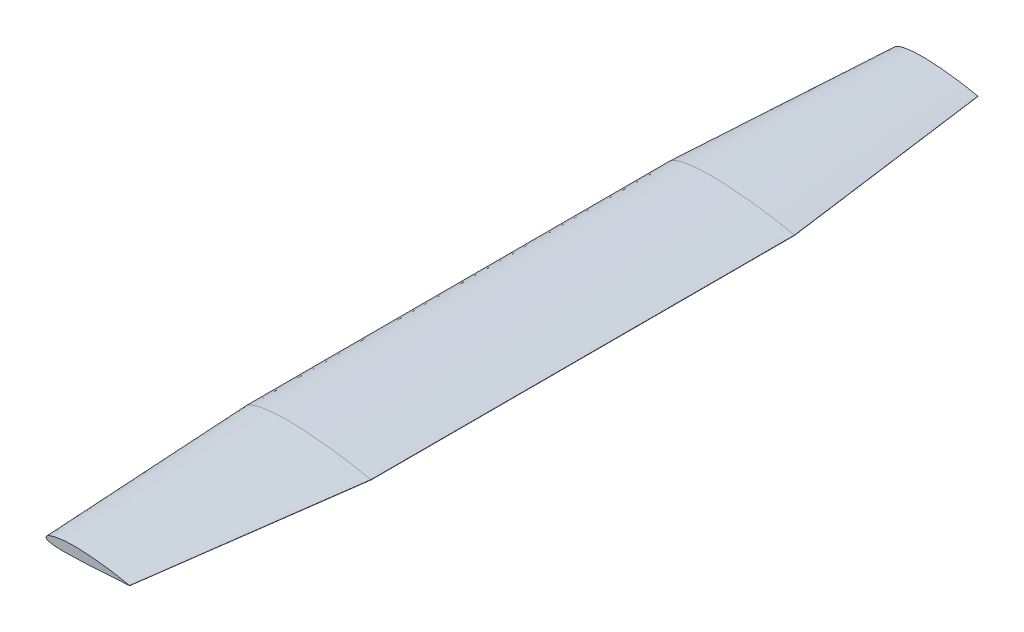
ISO-10303-21;
HEADER;
FILE_DESCRIPTION(('STEP AP214'),'2;1');
FILE_NAME('part.step','',(''),(''),'','','');
FILE_SCHEMA(('AUTOMOTIVE_DESIGN { 1 0 10303 214 1 1 1 1 }'));
ENDSEC;
DATA;
#1=APPLICATION_CONTEXT('core data for automotive mechanical design processes');
#2=APPLICATION_PROTOCOL_DEFINITION('international standard','automotive_design',2000,#1);
#3=PRODUCT_CONTEXT('',#1,'mechanical');
#4=PRODUCT('Part','Part','',(#3));
#5=PRODUCT_RELATED_PRODUCT_CATEGORY('part','',(#4));
#6=PRODUCT_DEFINITION_FORMATION('','',#4);
#7=PRODUCT_DEFINITION_CONTEXT('part definition',#1,'design');
#8=PRODUCT_DEFINITION('design','',#6,#7);
#9=PRODUCT_DEFINITION_SHAPE('','',#8);
#10=(LENGTH_UNIT() NAMED_UNIT(*) SI_UNIT(.MILLI.,.METRE.));
#11=(NAMED_UNIT(*) PLANE_ANGLE_UNIT() SI_UNIT($,.RADIAN.));
#12=(NAMED_UNIT(*) SI_UNIT($,.STERADIAN.) SOLID_ANGLE_UNIT());
#13=UNCERTAINTY_MEASURE_WITH_UNIT(LENGTH_MEASURE(1.E-05),#10,'distance_accuracy_value','');
#14=(GEOMETRIC_REPRESENTATION_CONTEXT(3) GLOBAL_UNCERTAINTY_ASSIGNED_CONTEXT((#13)) GLOBAL_UNIT_ASSIGNED_CONTEXT((#10,
#11,#12)) REPRESENTATION_CONTEXT('',''));
#15=CARTESIAN_POINT('',(0.,0.,0.));
#16=DIRECTION('',(0.,0.,1.));
#17=DIRECTION('',(1.,0.,0.));
#18=AXIS2_PLACEMENT_3D('',#15,#16,#17);
#19=CARTESIAN_POINT('',(1625.6,2.11328,5486.4));
#20=CARTESIAN_POINT('',(1598.52169370127,7.66199511075688,5486.4));
#21=CARTESIAN_POINT('',(1544.43620014385,18.7448520687989,5486.4));
#22=CARTESIAN_POINT('',(1436.1723308759,39.0446325492467,5486.4));
#23=CARTESIAN_POINT('',(1300.76956838146,61.5368060692491,5486.4));
#24=CARTESIAN_POINT('',(1138.1787242516,84.8156571255561,5486.4));
#25=CARTESIAN_POINT('',(975.614700872727,104.229358723252,5486.4));
#26=CARTESIAN_POINT('',(812.980199669163,118.444361608533,5486.4));
#27=CARTESIAN_POINT('',(650.382735903934,128.070713408271,5486.4));
#28=CARTESIAN_POINT('',(514.722747681028,129.700167154986,5486.4));
#29=CARTESIAN_POINT('',(406.301680859599,125.211654252031,5486.4));
#30=CARTESIAN_POINT('',(324.919391398577,118.634685795919,5486.4));
#31=CARTESIAN_POINT('',(243.43435771354,108.219628357568,5486.4));
#32=CARTESIAN_POINT('',(175.618548868987,95.3942907523483,5486.4));
#33=CARTESIAN_POINT('',(121.55445518343,80.8842962117694,5486.4));
#34=CARTESIAN_POINT('',(80.5662368350857,67.6925647696942,5486.4));
#35=CARTESIAN_POINT('',(45.8390479430345,52.322216291585,5486.4));
#36=CARTESIAN_POINT('',(15.8836887622906,33.6873689894672,5486.4));
#37=CARTESIAN_POINT('',(-10.2384010017586,1.46104242818783,5486.4));
#38=CARTESIAN_POINT('',(16.8954903358554,-26.8653169147899,5486.4));
#39=CARTESIAN_POINT('',(46.2905410335916,-39.7847190927755,5486.4));
#40=CARTESIAN_POINT('',(80.8649484942796,-49.5983753689919,5486.4));
#41=CARTESIAN_POINT('',(121.718222256781,-56.6347934295591,5486.4));
#42=CARTESIAN_POINT('',(175.998691039988,-62.6395924491309,5486.4));
#43=CARTESIAN_POINT('',(243.753893927156,-67.2614084985653,5486.4));
#44=CARTESIAN_POINT('',(325.110428583479,-69.1144306978824,5486.4));
#45=CARTESIAN_POINT('',(406.408899059161,-68.8562058283363,5486.4));
#46=CARTESIAN_POINT('',(514.792274364525,-66.4638135907844,5486.4));
#47=CARTESIAN_POINT('',(650.284140648558,-62.158841889232,5486.4));
#48=CARTESIAN_POINT('',(812.85427741131,-54.6668864942952,5486.4));
#49=CARTESIAN_POINT('',(975.377273813588,-44.929205791749,5486.4));
#50=CARTESIAN_POINT('',(1137.92783562088,-34.8076662907094,5486.4));
#51=CARTESIAN_POINT('',(1300.50619076992,-24.5624825013092,5486.4));
#52=CARTESIAN_POINT('',(1435.94357677853,-15.1267131409481,5486.4));
#53=CARTESIAN_POINT('',(1544.3268932205,-7.84873152397608,5486.4));
#54=CARTESIAN_POINT('',(1598.5077241538,-4.02518469944305,5486.4));
#55=CARTESIAN_POINT('',(1625.6,-2.11328,5486.4));
#56=B_SPLINE_CURVE_WITH_KNOTS('',3,(#19,#20,#21,#22,#23,#24,#25,#26,#27,#28,#29,#30,#31,#32,#33,
#34,#35,#36,#37,#38,#39,#40,#41,#42,#43,#44,#45,#46,#47,#48,#49,#50,#51,#52,#53,#54,#55),
.UNSPECIFIED.,.F.,.F.,(4,1,1,1,1,1,1,1,1,1,1,1,1,1,1,1,1,1,1,1,1,1,1,1,1,1,1,1,1,1,1,1,1,1,4),
(0.,0.0250124897498648,0.0499592861642578,0.0996729249269685,0.149206319909966,
0.198581096615965,0.247805170456833,0.296916574601493,0.345952721793533,0.370491625569911,
0.395091203654929,0.41981479582396,0.444798575016595,0.457489818915221,0.47040640543549,
0.483879408669829,0.491264120322896,0.503458853294664,0.513609129403887,0.520450990700287,
0.533235387615153,0.545691039147803,0.558031884237173,0.582609167247894,0.607134741746914,
0.631652079836766,0.656174271859652,0.705233949250519,0.754320378530032,0.803437363555032,
0.852566095729537,0.901700994033254,0.95084880933727,0.975422716989278,1.),.UNSPECIFIED.);
#57=DIRECTION('',(0.,0.,-1.));
#58=VECTOR('',#57,1.);
#59=SURFACE_OF_LINEAR_EXTRUSION('',#56,#58);
#60=CARTESIAN_POINT('',(1625.6,2.11328,0.));
#61=CARTESIAN_POINT('',(1598.52169370127,7.66199511075688,0.));
#62=CARTESIAN_POINT('',(1544.43620014385,18.7448520687989,0.));
#63=CARTESIAN_POINT('',(1436.1723308759,39.0446325492467,0.));
#64=CARTESIAN_POINT('',(1300.76956838146,61.5368060692491,0.));
#65=CARTESIAN_POINT('',(1138.1787242516,84.8156571255561,0.));
#66=CARTESIAN_POINT('',(975.614700872727,104.229358723252,0.));
#67=CARTESIAN_POINT('',(812.980199669163,118.444361608533,0.));
#68=CARTESIAN_POINT('',(650.382735903934,128.070713408271,0.));
#69=CARTESIAN_POINT('',(514.722747681028,129.700167154986,0.));
#70=CARTESIAN_POINT('',(406.301680859599,125.211654252031,0.));
#71=CARTESIAN_POINT('',(324.919391398577,118.634685795919,0.));
#72=CARTESIAN_POINT('',(243.43435771354,108.219628357568,0.));
#73=CARTESIAN_POINT('',(175.618548868987,95.3942907523483,0.));
#74=CARTESIAN_POINT('',(121.55445518343,80.8842962117694,0.));
#75=CARTESIAN_POINT('',(80.5662368350857,67.6925647696942,0.));
#76=CARTESIAN_POINT('',(45.8390479430345,52.322216291585,0.));
#77=CARTESIAN_POINT('',(15.8836887622906,33.6873689894672,0.));
#78=CARTESIAN_POINT('',(-10.2384010017586,1.46104242818783,0.));
#79=CARTESIAN_POINT('',(16.8954903358554,-26.8653169147899,0.));
#80=CARTESIAN_POINT('',(46.2905410335916,-39.7847190927755,0.));
#81=CARTESIAN_POINT('',(80.8649484942796,-49.5983753689919,0.));
#82=CARTESIAN_POINT('',(121.718222256781,-56.6347934295591,0.));
#83=CARTESIAN_POINT('',(175.998691039988,-62.6395924491309,0.));
#84=CARTESIAN_POINT('',(243.753893927156,-67.2614084985653,0.));
#85=CARTESIAN_POINT('',(325.110428583479,-69.1144306978824,0.));
#86=CARTESIAN_POINT('',(406.408899059161,-68.8562058283363,0.));
#87=CARTESIAN_POINT('',(514.792274364525,-66.4638135907844,0.));
#88=CARTESIAN_POINT('',(650.284140648558,-62.158841889232,0.));
#89=CARTESIAN_POINT('',(812.85427741131,-54.6668864942952,0.));
#90=CARTESIAN_POINT('',(975.377273813588,-44.929205791749,0.));
#91=CARTESIAN_POINT('',(1137.92783562088,-34.8076662907094,0.));
#92=CARTESIAN_POINT('',(1300.50619076992,-24.5624825013092,0.));
#93=CARTESIAN_POINT('',(1435.94357677853,-15.1267131409481,0.));
#94=CARTESIAN_POINT('',(1544.3268932205,-7.84873152397608,0.));
#95=CARTESIAN_POINT('',(1598.5077241538,-4.02518469944305,0.));
#96=CARTESIAN_POINT('',(1625.6,-2.11328,0.));
#97=B_SPLINE_CURVE_WITH_KNOTS('',3,(#60,#61,#62,#63,#64,#65,#66,#67,#68,#69,#70,#71,#72,#73,#74,
#75,#76,#77,#78,#79,#80,#81,#82,#83,#84,#85,#86,#87,#88,#89,#90,#91,#92,#93,#94,#95,#96),
.UNSPECIFIED.,.F.,.F.,(4,1,1,1,1,1,1,1,1,1,1,1,1,1,1,1,1,1,1,1,1,1,1,1,1,1,1,1,1,1,1,1,1,1,4),
(0.,0.0250124897498648,0.0499592861642578,0.0996729249269685,0.149206319909966,
0.198581096615965,0.247805170456833,0.296916574601493,0.345952721793533,0.370491625569911,
0.395091203654929,0.41981479582396,0.444798575016595,0.457489818915221,0.47040640543549,
0.483879408669829,0.491264120322896,0.503458853294664,0.513609129403887,0.520450990700287,
0.533235387615153,0.545691039147803,0.558031884237173,0.582609167247894,0.607134741746914,
0.631652079836766,0.656174271859652,0.705233949250519,0.754320378530032,0.803437363555032,
0.852566095729537,0.901700994033254,0.95084880933727,0.975422716989278,1.),.UNSPECIFIED.);
#98=CARTESIAN_POINT('',(1625.6,2.11328,0.));
#99=VERTEX_POINT('',#98);
#100=CARTESIAN_POINT('',(1625.6,-2.11328,0.));
#101=VERTEX_POINT('',#100);
#102=EDGE_CURVE('E155',#99,#101,#97,.T.);
#103=ORIENTED_EDGE('',*,*,#102,.T.);
#104=DIRECTION('',(0.,0.,-1.));
#105=VECTOR('',#104,1.);
#106=CARTESIAN_POINT('',(1625.6,-2.11328,5486.4));
#107=LINE('',#106,#105);
#108=CARTESIAN_POINT('',(1625.6,-2.11328,5486.4));
#109=VERTEX_POINT('',#108);
#110=EDGE_CURVE('E148',#109,#101,#107,.T.);
#111=ORIENTED_EDGE('',*,*,#110,.F.);
#112=CARTESIAN_POINT('',(1625.6,2.11328,5486.4));
#113=CARTESIAN_POINT('',(1598.52169370127,7.66199511075688,5486.4));
#114=CARTESIAN_POINT('',(1544.43620014385,18.7448520687989,5486.4));
#115=CARTESIAN_POINT('',(1436.1723308759,39.0446325492467,5486.4));
#116=CARTESIAN_POINT('',(1300.76956838146,61.5368060692491,5486.4));
#117=CARTESIAN_POINT('',(1138.1787242516,84.8156571255561,5486.4));
#118=CARTESIAN_POINT('',(975.614700872727,104.229358723252,5486.4));
#119=CARTESIAN_POINT('',(812.980199669163,118.444361608533,5486.4));
#120=CARTESIAN_POINT('',(650.382735903934,128.070713408271,5486.4));
#121=CARTESIAN_POINT('',(514.722747681028,129.700167154986,5486.4));
#122=CARTESIAN_POINT('',(406.301680859599,125.211654252031,5486.4));
#123=CARTESIAN_POINT('',(324.919391398577,118.634685795919,5486.4));
#124=CARTESIAN_POINT('',(243.43435771354,108.219628357568,5486.4));
#125=CARTESIAN_POINT('',(175.618548868987,95.3942907523483,5486.4));
#126=CARTESIAN_POINT('',(121.55445518343,80.8842962117694,5486.4));
#127=CARTESIAN_POINT('',(80.5662368350857,67.6925647696942,5486.4));
#128=CARTESIAN_POINT('',(45.8390479430345,52.322216291585,5486.4));
#129=CARTESIAN_POINT('',(15.8836887622906,33.6873689894672,5486.4));
#130=CARTESIAN_POINT('',(-10.2384010017586,1.46104242818783,5486.4));
#131=CARTESIAN_POINT('',(16.8954903358554,-26.8653169147899,5486.4));
#132=CARTESIAN_POINT('',(46.2905410335916,-39.7847190927755,5486.4));
#133=CARTESIAN_POINT('',(80.8649484942796,-49.5983753689919,5486.4));
#134=CARTESIAN_POINT('',(121.718222256781,-56.6347934295591,5486.4));
#135=CARTESIAN_POINT('',(175.998691039988,-62.6395924491309,5486.4));
#136=CARTESIAN_POINT('',(243.753893927156,-67.2614084985653,5486.4));
#137=CARTESIAN_POINT('',(325.110428583479,-69.1144306978824,5486.4));
#138=CARTESIAN_POINT('',(406.408899059161,-68.8562058283363,5486.4));
#139=CARTESIAN_POINT('',(514.792274364525,-66.4638135907844,5486.4));
#140=CARTESIAN_POINT('',(650.284140648558,-62.158841889232,5486.4));
#141=CARTESIAN_POINT('',(812.85427741131,-54.6668864942952,5486.4));
#142=CARTESIAN_POINT('',(975.377273813588,-44.929205791749,5486.4));
#143=CARTESIAN_POINT('',(1137.92783562088,-34.8076662907094,5486.4));
#144=CARTESIAN_POINT('',(1300.50619076992,-24.5624825013092,5486.4));
#145=CARTESIAN_POINT('',(1435.94357677853,-15.1267131409481,5486.4));
#146=CARTESIAN_POINT('',(1544.3268932205,-7.84873152397608,5486.4));
#147=CARTESIAN_POINT('',(1598.5077241538,-4.02518469944305,5486.4));
#148=CARTESIAN_POINT('',(1625.6,-2.11328,5486.4));
#149=B_SPLINE_CURVE_WITH_KNOTS('',3,(#112,#113,#114,#115,#116,#117,#118,#119,#120,#121,#122,
#123,#124,#125,#126,#127,#128,#129,#130,#131,#132,#133,#134,#135,#136,#137,#138,#139,#140,#141,
#142,#143,#144,#145,#146,#147,#148),.UNSPECIFIED.,.F.,.F.,(4,1,1,1,1,1,1,1,1,1,1,1,1,1,1,1,1,1,
1,1,1,1,1,1,1,1,1,1,1,1,1,1,1,1,4),(0.,0.0250124898223497,0.0499592861979505,0.0996729249941258,
0.149206319909966,0.198581096637888,0.247805170513599,0.296916574601493,0.345952721804581,
0.370491625569911,0.395091203665741,0.419814795828645,0.44479857501714,0.457489818916541,
0.470406405441901,0.483879408669829,0.491264120327147,0.503458853294664,0.513609129403887,
0.520450990700287,0.533235387615153,0.545691039147803,0.558031884237173,0.582609167247894,
0.607134741746914,0.6316520798645,0.656174271859652,0.705233949272872,0.754320378530032,
0.803437363555032,0.852566095740532,0.901700994033254,0.95084880933727,0.975422716989278,1.),.UNSPECIFIED.);
#150=CARTESIAN_POINT('',(1625.6,2.11328,5486.4));
#151=VERTEX_POINT('',#150);
#152=EDGE_CURVE('E154',#151,#109,#149,.T.);
#153=ORIENTED_EDGE('',*,*,#152,.F.);
#154=DIRECTION('',(0.,0.,-1.));
#155=VECTOR('',#154,1.);
#156=CARTESIAN_POINT('',(1625.6,2.11328,5486.4));
#157=LINE('',#156,#155);
#158=EDGE_CURVE('E172',#151,#99,#157,.T.);
#159=ORIENTED_EDGE('',*,*,#158,.T.);
#160=EDGE_LOOP('',(#103,#111,#153,#159));
#161=FACE_BOUND('',#160,.T.);
#162=DIRECTION('',(0.,0.,-1.));
#163=VECTOR('',#162,1.);
#164=CARTESIAN_POINT('',(10.7516738005474,-19.05,5486.4));
#165=LINE('',#164,#163);
#166=CARTESIAN_POINT('',(10.7516738005475,-19.05,3743.198));
#167=VERTEX_POINT('',#166);
#168=CARTESIAN_POINT('',(10.7516738005475,-19.05,1743.202));
#169=VERTEX_POINT('',#168);
#170=EDGE_CURVE('E12',#167,#169,#165,.T.);
#171=ORIENTED_EDGE('',*,*,#170,.F.);
#172=CARTESIAN_POINT('',(1625.6,2.11328,3743.198));
#173=CARTESIAN_POINT('',(1598.52169370127,7.66199511075688,3743.198));
#174=CARTESIAN_POINT('',(1544.43620014385,18.7448520687989,3743.198));
#175=CARTESIAN_POINT('',(1436.1723308759,39.0446325492467,3743.198));
#176=CARTESIAN_POINT('',(1300.76956838146,61.5368060692491,3743.198));
#177=CARTESIAN_POINT('',(1138.1787242516,84.8156571255561,3743.198));
#178=CARTESIAN_POINT('',(975.614700872727,104.229358723252,3743.198));
#179=CARTESIAN_POINT('',(812.980199669163,118.444361608533,3743.198));
#180=CARTESIAN_POINT('',(650.382735903934,128.070713408271,3743.198));
#181=CARTESIAN_POINT('',(514.722747681028,129.700167154986,3743.198));
#182=CARTESIAN_POINT('',(406.301680859599,125.211654252031,3743.198));
#183=CARTESIAN_POINT('',(324.919391398577,118.634685795919,3743.198));
#184=CARTESIAN_POINT('',(243.43435771354,108.219628357568,3743.198));
#185=CARTESIAN_POINT('',(175.618548868987,95.3942907523483,3743.198));
#186=CARTESIAN_POINT('',(121.55445518343,80.8842962117694,3743.198));
#187=CARTESIAN_POINT('',(80.5662368350857,67.6925647696942,3743.198));
#188=CARTESIAN_POINT('',(45.8390479430345,52.322216291585,3743.198));
#189=CARTESIAN_POINT('',(15.8836887622906,33.6873689894672,3743.198));
#190=CARTESIAN_POINT('',(-10.2384010017586,1.46104242818783,3743.198));
#191=CARTESIAN_POINT('',(16.8954903358554,-26.8653169147899,3743.198));
#192=CARTESIAN_POINT('',(46.2905410335916,-39.7847190927755,3743.198));
#193=CARTESIAN_POINT('',(80.8649484942796,-49.5983753689919,3743.198));
#194=CARTESIAN_POINT('',(121.718222256781,-56.6347934295591,3743.198));
#195=CARTESIAN_POINT('',(175.998691039988,-62.6395924491309,3743.198));
#196=CARTESIAN_POINT('',(243.753893927156,-67.2614084985653,3743.198));
#197=CARTESIAN_POINT('',(325.110428583479,-69.1144306978824,3743.198));
#198=CARTESIAN_POINT('',(406.408899059161,-68.8562058283363,3743.198));
#199=CARTESIAN_POINT('',(514.792274364525,-66.4638135907844,3743.198));
#200=CARTESIAN_POINT('',(650.284140648558,-62.158841889232,3743.198));
#201=CARTESIAN_POINT('',(812.85427741131,-54.6668864942952,3743.198));
#202=CARTESIAN_POINT('',(975.377273813588,-44.929205791749,3743.198));
#203=CARTESIAN_POINT('',(1137.92783562088,-34.8076662907094,3743.198));
#204=CARTESIAN_POINT('',(1300.50619076992,-24.5624825013092,3743.198));
#205=CARTESIAN_POINT('',(1435.94357677853,-15.1267131409481,3743.198));
#206=CARTESIAN_POINT('',(1544.3268932205,-7.84873152397608,3743.198));
#207=CARTESIAN_POINT('',(1598.5077241538,-4.02518469944305,3743.198));
#208=CARTESIAN_POINT('',(1625.6,-2.11328,3743.198));
#209=B_SPLINE_CURVE_WITH_KNOTS('',3,(#172,#173,#174,#175,#176,#177,#178,#179,#180,#181,#182,
#183,#184,#185,#186,#187,#188,#189,#190,#191,#192,#193,#194,#195,#196,#197,#198,#199,#200,#201,
#202,#203,#204,#205,#206,#207,#208),.UNSPECIFIED.,.F.,.F.,(4,1,1,1,1,1,1,1,1,1,1,1,1,1,1,1,1,1,
1,1,1,1,1,1,1,1,1,1,1,1,1,1,1,1,4),(0.,0.0250124897498648,0.0499592861642578,0.0996729249269685,
0.149206319909966,0.198581096615965,0.247805170456833,0.296916574601493,0.345952721793533,
0.370491625569911,0.395091203654929,0.41981479582396,0.444798575016595,0.457489818915221,
0.47040640543549,0.483879408669829,0.491264120322896,0.503458853294664,0.513609129403887,
0.520450990700287,0.533235387615153,0.545691039147803,0.558031884237173,0.582609167247894,
0.607134741746914,0.631652079836766,0.656174271859652,0.705233949250519,0.754320378530032,
0.803437363555032,0.852566095729537,0.901700994033254,0.95084880933727,0.975422716989278,1.),.UNSPECIFIED.);
#210=CARTESIAN_POINT('',(1379.42761825437,-19.05,3743.198));
#211=VERTEX_POINT('',#210);
#212=EDGE_CURVE('E134',#167,#211,#209,.T.);
#213=ORIENTED_EDGE('',*,*,#212,.T.);
#214=DIRECTION('',(0.,0.,-1.));
#215=VECTOR('',#214,1.);
#216=CARTESIAN_POINT('',(1379.42761825437,-19.05,5486.4));
#217=LINE('',#216,#215);
#218=CARTESIAN_POINT('',(1379.42761825437,-19.05,1743.202));
#219=VERTEX_POINT('',#218);
#220=EDGE_CURVE('E133',#219,#211,#217,.F.);
#221=ORIENTED_EDGE('',*,*,#220,.F.);
#222=CARTESIAN_POINT('',(1625.6,2.11328,1743.202));
#223=CARTESIAN_POINT('',(1598.52169370127,7.66199511075688,1743.202));
#224=CARTESIAN_POINT('',(1544.43620014385,18.7448520687989,1743.202));
#225=CARTESIAN_POINT('',(1436.1723308759,39.0446325492467,1743.202));
#226=CARTESIAN_POINT('',(1300.76956838146,61.5368060692491,1743.202));
#227=CARTESIAN_POINT('',(1138.1787242516,84.8156571255561,1743.202));
#228=CARTESIAN_POINT('',(975.614700872727,104.229358723252,1743.202));
#229=CARTESIAN_POINT('',(812.980199669163,118.444361608533,1743.202));
#230=CARTESIAN_POINT('',(650.382735903934,128.070713408271,1743.202));
#231=CARTESIAN_POINT('',(514.722747681028,129.700167154986,1743.202));
#232=CARTESIAN_POINT('',(406.301680859599,125.211654252031,1743.202));
#233=CARTESIAN_POINT('',(324.919391398577,118.634685795919,1743.202));
#234=CARTESIAN_POINT('',(243.43435771354,108.219628357568,1743.202));
#235=CARTESIAN_POINT('',(175.618548868987,95.3942907523483,1743.202));
#236=CARTESIAN_POINT('',(121.55445518343,80.8842962117694,1743.202));
#237=CARTESIAN_POINT('',(80.5662368350857,67.6925647696942,1743.202));
#238=CARTESIAN_POINT('',(45.8390479430345,52.322216291585,1743.202));
#239=CARTESIAN_POINT('',(15.8836887622906,33.6873689894672,1743.202));
#240=CARTESIAN_POINT('',(-10.2384010017586,1.46104242818783,1743.202));
#241=CARTESIAN_POINT('',(16.8954903358554,-26.8653169147899,1743.202));
#242=CARTESIAN_POINT('',(46.2905410335916,-39.7847190927755,1743.202));
#243=CARTESIAN_POINT('',(80.8649484942796,-49.5983753689919,1743.202));
#244=CARTESIAN_POINT('',(121.718222256781,-56.6347934295591,1743.202));
#245=CARTESIAN_POINT('',(175.998691039988,-62.6395924491309,1743.202));
#246=CARTESIAN_POINT('',(243.753893927156,-67.2614084985653,1743.202));
#247=CARTESIAN_POINT('',(325.110428583479,-69.1144306978824,1743.202));
#248=CARTESIAN_POINT('',(406.408899059161,-68.8562058283363,1743.202));
#249=CARTESIAN_POINT('',(514.792274364525,-66.4638135907844,1743.202));
#250=CARTESIAN_POINT('',(650.284140648558,-62.158841889232,1743.202));
#251=CARTESIAN_POINT('',(812.85427741131,-54.6668864942952,1743.202));
#252=CARTESIAN_POINT('',(975.377273813588,-44.929205791749,1743.202));
#253=CARTESIAN_POINT('',(1137.92783562088,-34.8076662907094,1743.202));
#254=CARTESIAN_POINT('',(1300.50619076992,-24.5624825013092,1743.202));
#255=CARTESIAN_POINT('',(1435.94357677853,-15.1267131409481,1743.202));
#256=CARTESIAN_POINT('',(1544.3268932205,-7.84873152397608,1743.202));
#257=CARTESIAN_POINT('',(1598.5077241538,-4.02518469944305,1743.202));
#258=CARTESIAN_POINT('',(1625.6,-2.11328,1743.202));
#259=B_SPLINE_CURVE_WITH_KNOTS('',3,(#222,#223,#224,#225,#226,#227,#228,#229,#230,#231,#232,
#233,#234,#235,#236,#237,#238,#239,#240,#241,#242,#243,#244,#245,#246,#247,#248,#249,#250,#251,
#252,#253,#254,#255,#256,#257,#258),.UNSPECIFIED.,.F.,.F.,(4,1,1,1,1,1,1,1,1,1,1,1,1,1,1,1,1,1,
1,1,1,1,1,1,1,1,1,1,1,1,1,1,1,1,4),(0.,0.0250124897498648,0.0499592861642578,0.0996729249269685,
0.149206319909966,0.198581096615965,0.247805170456833,0.296916574601493,0.345952721793533,
0.370491625569911,0.395091203654929,0.41981479582396,0.444798575016595,0.457489818915221,
0.47040640543549,0.483879408669829,0.491264120322896,0.503458853294664,0.513609129403887,
0.520450990700287,0.533235387615153,0.545691039147803,0.558031884237173,0.582609167247894,
0.607134741746914,0.631652079836766,0.656174271859652,0.705233949250519,0.754320378530032,
0.803437363555032,0.852566095729537,0.901700994033254,0.95084880933727,0.975422716989278,1.),.UNSPECIFIED.);
#260=EDGE_CURVE('E77',#169,#219,#259,.T.);
#261=ORIENTED_EDGE('',*,*,#260,.F.);
#262=EDGE_LOOP('',(#171,#213,#221,#261));
#263=FACE_BOUND('',#262,.T.);
#264=ADVANCED_FACE('F68',(#161,#263),#59,.F.);
#265=CARTESIAN_POINT('',(1625.6,2.11328,5486.4));
#266=DIRECTION('',(-1.,0.,0.));
#267=DIRECTION('',(0.,-1.,0.));
#268=AXIS2_PLACEMENT_3D('',#265,#266,#267);
#269=PLANE('',#268);
#270=DIRECTION('',(0.,-1.,0.));
#271=VECTOR('',#270,1.);
#272=CARTESIAN_POINT('',(1625.6,2.11328,0.));
#273=LINE('',#272,#271);
#274=EDGE_CURVE('E151',#101,#99,#273,.F.);
#275=ORIENTED_EDGE('',*,*,#274,.T.);
#276=ORIENTED_EDGE('',*,*,#158,.F.);
#277=DIRECTION('',(0.,1.,0.));
#278=VECTOR('',#277,1.);
#279=CARTESIAN_POINT('',(1625.6,1.22918643356768E-10,5486.4));
#280=LINE('',#279,#278);
#281=EDGE_CURVE('E92',#109,#151,#280,.T.);
#282=ORIENTED_EDGE('',*,*,#281,.F.);
#283=ORIENTED_EDGE('',*,*,#110,.T.);
#284=EDGE_LOOP('',(#275,#276,#282,#283));
#285=FACE_BOUND('',#284,.T.);
#286=ADVANCED_FACE('F212',(#285),#269,.F.);
#287=CARTESIAN_POINT('',(0.,0.,8232.14));
#288=DIRECTION('',(0.,0.,1.));
#289=DIRECTION('',(1.,0.,0.));
#290=AXIS2_PLACEMENT_3D('',#287,#288,#289);
#291=PLANE('',#290);
#292=DIRECTION('',(0.,-1.,0.));
#293=VECTOR('',#292,1.);
#294=CARTESIAN_POINT('',(1245.80389892952,0.,8232.14));
#295=LINE('',#294,#293);
#296=CARTESIAN_POINT('',(1245.80389892952,-2.56699157955452,8232.14));
#297=VERTEX_POINT('',#296);
#298=CARTESIAN_POINT('',(1245.80389892952,-5.3851102031597,8232.14));
#299=VERTEX_POINT('',#298);
#300=EDGE_CURVE('E237',#297,#299,#295,.T.);
#301=ORIENTED_EDGE('',*,*,#300,.F.);
#302=CARTESIAN_POINT('',(1245.80389892952,-2.56699157955452,8232.14));
#303=CARTESIAN_POINT('',(1227.7490554963,1.13269262210123,8232.14));
#304=CARTESIAN_POINT('',(1191.68678833515,8.52234407964617,8232.14));
#305=CARTESIAN_POINT('',(1119.50032355401,22.0575096578315,8232.14));
#306=CARTESIAN_POINT('',(1029.21861829007,37.0544841129072,8232.14));
#307=CARTESIAN_POINT('',(920.808875359358,52.575987063591,8232.14));
#308=CARTESIAN_POINT('',(812.417015532101,65.5203469274271,8232.14));
#309=CARTESIAN_POINT('',(703.978163622847,74.9984009834673,8232.14));
#310=CARTESIAN_POINT('',(595.564006948364,81.4169070801056,8232.14));
#311=CARTESIAN_POINT('',(505.11079280858,82.5033683840075,8232.14));
#312=CARTESIAN_POINT('',(432.819514347779,79.5105889641269,8232.14));
#313=CARTESIAN_POINT('',(378.556722814038,75.1253023259452,8232.14));
#314=CARTESIAN_POINT('',(324.225425087131,68.1809156186669,8232.14));
#315=CARTESIAN_POINT('',(279.008276231165,59.6294404825758,8232.14));
#316=CARTESIAN_POINT('',(242.960277755862,49.9546966235492,8232.14));
#317=CARTESIAN_POINT('',(215.630803962379,41.1589232431099,8232.14));
#318=CARTESIAN_POINT('',(192.475960033256,30.9105261818475,8232.14));
#319=CARTESIAN_POINT('',(172.50280098196,18.4854784295708,8232.14));
#320=CARTESIAN_POINT('',(155.085528507404,-3.00188020453124,8232.14));
#321=CARTESIAN_POINT('',(173.177433976302,-21.8888805976992,8232.14));
#322=CARTESIAN_POINT('',(192.776999435033,-30.5030745305683,8232.14));
#323=CARTESIAN_POINT('',(215.829974176024,-37.0464685774481,8232.14));
#324=CARTESIAN_POINT('',(243.069471772426,-41.7380997400764,8232.14));
#325=CARTESIAN_POINT('',(279.261741388299,-45.7418843301433,8232.14));
#326=CARTESIAN_POINT('',(324.43848037795,-48.8235454827634,8232.14));
#327=CARTESIAN_POINT('',(378.684099556132,-50.0590742425034,8232.14));
#328=CARTESIAN_POINT('',(432.891003596554,-49.8868991359247,8232.14));
#329=CARTESIAN_POINT('',(505.157150708202,-48.291737845367,8232.14));
#330=CARTESIAN_POINT('',(595.498267167706,-45.421337084465,8232.14));
#331=CARTESIAN_POINT('',(703.894203178503,-40.4259699875689,8232.14));
#332=CARTESIAN_POINT('',(812.258707684817,-33.9332337491788,8232.14));
#333=CARTESIAN_POINT('',(920.641591818693,-27.1845542967286,8232.14));
#334=CARTESIAN_POINT('',(1029.04300754961,-20.3534331735004,8232.14));
#335=CARTESIAN_POINT('',(1119.34779852077,-14.0620006673725,8232.14));
#336=CARTESIAN_POINT('',(1191.61390640572,-9.20930353146111,8232.14));
#337=CARTESIAN_POINT('',(1227.73974110406,-6.65989967295296,8232.14));
#338=CARTESIAN_POINT('',(1245.80389892952,-5.3851102031597,8232.14));
#339=B_SPLINE_CURVE_WITH_KNOTS('',3,(#302,#303,#304,#305,#306,#307,#308,#309,#310,#311,#312,
#313,#314,#315,#316,#317,#318,#319,#320,#321,#322,#323,#324,#325,#326,#327,#328,#329,#330,#331,
#332,#333,#334,#335,#336,#337,#338),.UNSPECIFIED.,.F.,.F.,(4,1,1,1,1,1,1,1,1,1,1,1,1,1,1,1,1,1,
1,1,1,1,1,1,1,1,1,1,1,1,1,1,1,1,4),(0.,0.0250124898223497,0.0499592861979505,0.0996729249941258,
0.14920631989706,0.198581096637888,0.247805170513599,0.296916574577904,0.345952721804581,
0.370491625540863,0.395091203665741,0.419814795828645,0.44479857501714,0.457489818916541,
0.470406405441901,0.483879408668269,0.491264120327147,0.503458853292774,0.51360912939893,
0.520450990699983,0.533235387608729,0.545691039144224,0.558031884236042,0.582609167240851,
0.607134741734321,0.6316520798645,0.656174271847113,0.705233949272872,0.754320378471855,
0.803437363531675,0.852566095740532,0.901700993964388,0.950848809302716,0.97542271691494,1.),.UNSPECIFIED.);
#340=EDGE_CURVE('E229',#297,#299,#339,.T.);
#341=ORIENTED_EDGE('',*,*,#340,.T.);
#342=EDGE_LOOP('',(#301,#341));
#343=FACE_BOUND('',#342,.T.);
#344=ADVANCED_FACE('F201',(#343),#291,.T.);
#345=CARTESIAN_POINT('',(1245.80389892952,-5.3851102031597,8232.14));
#346=CARTESIAN_POINT('',(1625.6,-2.11328,5486.4));
#347=CARTESIAN_POINT('',(1227.73974110406,-6.65989967295296,8232.14));
#348=CARTESIAN_POINT('',(1598.5077241538,-4.02518469944305,5486.4));
#349=CARTESIAN_POINT('',(1191.61390640572,-9.20930353146111,8232.14));
#350=CARTESIAN_POINT('',(1544.3268932205,-7.84873152397608,5486.4));
#351=CARTESIAN_POINT('',(1119.34779852077,-14.0620006673725,8232.14));
#352=CARTESIAN_POINT('',(1435.94357677853,-15.1267131409481,5486.4));
#353=CARTESIAN_POINT('',(1029.04300754961,-20.3534331735004,8232.14));
#354=CARTESIAN_POINT('',(1300.50619076992,-24.5624825013092,5486.4));
#355=CARTESIAN_POINT('',(920.641591818693,-27.1845542967286,8232.14));
#356=CARTESIAN_POINT('',(1137.92783562088,-34.8076662907094,5486.4));
#357=CARTESIAN_POINT('',(812.258707684817,-33.9332337491788,8232.14));
#358=CARTESIAN_POINT('',(975.377273813588,-44.929205791749,5486.4));
#359=CARTESIAN_POINT('',(703.894203178503,-40.4259699875689,8232.14));
#360=CARTESIAN_POINT('',(812.85427741131,-54.6668864942952,5486.4));
#361=CARTESIAN_POINT('',(595.498267167706,-45.421337084465,8232.14));
#362=CARTESIAN_POINT('',(650.284140648558,-62.158841889232,5486.4));
#363=CARTESIAN_POINT('',(505.157150708202,-48.291737845367,8232.14));
#364=CARTESIAN_POINT('',(514.792274364525,-66.4638135907844,5486.4));
#365=CARTESIAN_POINT('',(432.891003596554,-49.8868991359247,8232.14));
#366=CARTESIAN_POINT('',(406.408899059161,-68.8562058283363,5486.4));
#367=CARTESIAN_POINT('',(378.684099556132,-50.0590742425034,8232.14));
#368=CARTESIAN_POINT('',(325.110428583479,-69.1144306978824,5486.4));
#369=CARTESIAN_POINT('',(324.43848037795,-48.8235454827634,8232.14));
#370=CARTESIAN_POINT('',(243.753893927156,-67.2614084985653,5486.4));
#371=CARTESIAN_POINT('',(279.261741388299,-45.7418843301433,8232.14));
#372=CARTESIAN_POINT('',(175.998691039988,-62.6395924491309,5486.4));
#373=CARTESIAN_POINT('',(243.069471772426,-41.7380997400764,8232.14));
#374=CARTESIAN_POINT('',(121.718222256781,-56.6347934295591,5486.4));
#375=CARTESIAN_POINT('',(215.829974176024,-37.0464685774481,8232.14));
#376=CARTESIAN_POINT('',(80.8649484942796,-49.5983753689919,5486.4));
#377=CARTESIAN_POINT('',(192.776999435033,-30.5030745305683,8232.14));
#378=CARTESIAN_POINT('',(46.2905410335916,-39.7847190927755,5486.4));
#379=CARTESIAN_POINT('',(173.177433976302,-21.8888805976992,8232.14));
#380=CARTESIAN_POINT('',(16.8954903358554,-26.8653169147899,5486.4));
#381=CARTESIAN_POINT('',(155.085528507404,-3.00188020453124,8232.14));
#382=CARTESIAN_POINT('',(-10.2384010017586,1.46104242818783,5486.4));
#383=CARTESIAN_POINT('',(172.50280098196,18.4854784295708,8232.14));
#384=CARTESIAN_POINT('',(15.8836887622906,33.6873689894672,5486.4));
#385=CARTESIAN_POINT('',(192.475960033256,30.9105261818475,8232.14));
#386=CARTESIAN_POINT('',(45.8390479430345,52.322216291585,5486.4));
#387=CARTESIAN_POINT('',(215.630803962379,41.1589232431099,8232.14));
#388=CARTESIAN_POINT('',(80.5662368350857,67.6925647696942,5486.4));
#389=CARTESIAN_POINT('',(242.960277755862,49.9546966235492,8232.14));
#390=CARTESIAN_POINT('',(121.55445518343,80.8842962117694,5486.4));
#391=CARTESIAN_POINT('',(279.008276231165,59.6294404825758,8232.14));
#392=CARTESIAN_POINT('',(175.618548868987,95.3942907523483,5486.4));
#393=CARTESIAN_POINT('',(324.225425087131,68.1809156186669,8232.14));
#394=CARTESIAN_POINT('',(243.43435771354,108.219628357568,5486.4));
#395=CARTESIAN_POINT('',(378.556722814038,75.1253023259452,8232.14));
#396=CARTESIAN_POINT('',(324.919391398577,118.634685795919,5486.4));
#397=CARTESIAN_POINT('',(432.819514347779,79.5105889641269,8232.14));
#398=CARTESIAN_POINT('',(406.301680859599,125.211654252031,5486.4));
#399=CARTESIAN_POINT('',(505.11079280858,82.5033683840075,8232.14));
#400=CARTESIAN_POINT('',(514.722747681028,129.700167154986,5486.4));
#401=CARTESIAN_POINT('',(595.564006948364,81.4169070801056,8232.14));
#402=CARTESIAN_POINT('',(650.382735903934,128.070713408271,5486.4));
#403=CARTESIAN_POINT('',(703.978163622847,74.9984009834673,8232.14));
#404=CARTESIAN_POINT('',(812.980199669163,118.444361608533,5486.4));
#405=CARTESIAN_POINT('',(812.417015532101,65.5203469274271,8232.14));
#406=CARTESIAN_POINT('',(975.614700872727,104.229358723252,5486.4));
#407=CARTESIAN_POINT('',(920.808875359358,52.575987063591,8232.14));
#408=CARTESIAN_POINT('',(1138.1787242516,84.8156571255561,5486.4));
#409=CARTESIAN_POINT('',(1029.21861829007,37.0544841129072,8232.14));
#410=CARTESIAN_POINT('',(1300.76956838146,61.5368060692491,5486.4));
#411=CARTESIAN_POINT('',(1119.50032355401,22.0575096578315,8232.14));
#412=CARTESIAN_POINT('',(1436.1723308759,39.0446325492467,5486.4));
#413=CARTESIAN_POINT('',(1191.68678833515,8.52234407964617,8232.14));
#414=CARTESIAN_POINT('',(1544.43620014385,18.7448520687989,5486.4));
#415=CARTESIAN_POINT('',(1227.7490554963,1.13269262210123,8232.14));
#416=CARTESIAN_POINT('',(1598.52169370127,7.66199511075688,5486.4));
#417=CARTESIAN_POINT('',(1245.80389892952,-2.56699157955452,8232.14));
#418=CARTESIAN_POINT('',(1625.6,2.11328,5486.4));
#419=B_SPLINE_SURFACE_WITH_KNOTS('',3,1,((#345,#346),(#347,#348),(#349,#350),(#351,#352),(#353,
#354),(#355,#356),(#357,#358),(#359,#360),(#361,#362),(#363,#364),(#365,#366),(#367,#368),(#369,
#370),(#371,#372),(#373,#374),(#375,#376),(#377,#378),(#379,#380),(#381,#382),(#383,#384),(#385,
#386),(#387,#388),(#389,#390),(#391,#392),(#393,#394),(#395,#396),(#397,#398),(#399,#400),(#401,
#402),(#403,#404),(#405,#406),(#407,#408),(#409,#410),(#411,#412),(#413,#414),(#415,#416),(#417,
#418)),.UNSPECIFIED.,.F.,.F.,.F.,(4,1,1,1,1,1,1,1,1,1,1,1,1,1,1,1,1,1,1,1,1,1,1,1,1,1,1,1,1,1,1,
1,1,1,4),(2,2),(0.,0.0245772830107216,0.0491511906627297,0.0982990059667456,0.147433904259468,
0.196562636444968,0.245679621469968,0.294766050727128,0.343825728140348,0.3683479201355,
0.392865258253086,0.417390832752106,0.441968115762827,0.454308960852197,0.466764612384847,
0.479549009299713,0.486390870596113,0.496541146705336,0.508735879672853,0.516120591330171,
0.529593594558099,0.542510181083459,0.55520142498286,0.580185204171355,0.604908796334259,
0.629508374430089,0.654047278195419,0.703083425398507,0.752194829486401,0.801418903362112,
0.850793680090034,0.900327075005874,0.950040713802049,0.97498751017765,1.),(0.,1.),.UNSPECIFIED.);
#420=DIRECTION('',(0.137017187436166,0.00168847875599695,-0.990567231129));
#421=VECTOR('',#420,1.);
#422=CARTESIAN_POINT('',(1435.70194946476,-0.22685578977726,6859.27));
#423=LINE('',#422,#421);
#424=EDGE_CURVE('E332',#297,#151,#423,.T.);
#425=DIRECTION('',(-0.137017287301631,-0.00118036308873347,0.990567953107449));
#426=VECTOR('',#425,1.);
#427=CARTESIAN_POINT('',(1435.70194946476,-3.74919510157985,6859.27));
#428=LINE('',#427,#426);
#429=EDGE_CURVE('E236',#109,#299,#428,.T.);
#430=ORIENTED_EDGE('',*,*,#340,.F.);
#431=ORIENTED_EDGE('',*,*,#424,.T.);
#432=ORIENTED_EDGE('',*,*,#152,.T.);
#433=ORIENTED_EDGE('',*,*,#429,.T.);
#434=EDGE_LOOP('',(#430,#431,#432,#433));
#435=FACE_BOUND('',#434,.T.);
#436=ADVANCED_FACE('F211',(#435),#419,.T.);
#437=CARTESIAN_POINT('',(2339.72368498387,1.22918643356768E-10,323.635134112895));
#438=DIRECTION('',(0.990568643166048,0.,0.137017382751879));
#439=DIRECTION('',(0.137017382751879,0.,-0.990568643166048));
#440=AXIS2_PLACEMENT_3D('',#437,#438,#439);
#441=PLANE('',#440);
#442=ORIENTED_EDGE('',*,*,#429,.F.);
#443=ORIENTED_EDGE('',*,*,#281,.T.);
#444=ORIENTED_EDGE('',*,*,#424,.F.);
#445=ORIENTED_EDGE('',*,*,#300,.T.);
#446=EDGE_LOOP('',(#442,#443,#444,#445));
#447=FACE_BOUND('',#446,.T.);
#448=ADVANCED_FACE('F299',(#447),#441,.T.);
#449=CARTESIAN_POINT('',(0.,0.,-2745.74));
#450=DIRECTION('',(0.,0.,-1.));
#451=DIRECTION('',(-1.,0.,0.));
#452=AXIS2_PLACEMENT_3D('',#449,#450,#451);
#453=PLANE('',#452);
#454=CARTESIAN_POINT('',(1256.17241769584,3.06604253788097,-2745.74));
#455=CARTESIAN_POINT('',(1238.12021343908,6.76518593620912,-2745.74));
#456=CARTESIAN_POINT('',(1202.06321769922,14.1537572074787,-2745.74));
#457=CARTESIAN_POINT('',(1129.88730481339,27.6869442755574,-2745.74));
#458=CARTESIAN_POINT('',(1039.61879652626,42.6817265398277,-2745.74));
#459=CARTESIAN_POINT('',(931.224900448016,58.2009606264714,-2745.74));
#460=CARTESIAN_POINT('',(822.848884859155,71.1434283415438,-2745.74));
#461=CARTESIAN_POINT('',(714.425884057389,80.6200969379358,-2745.74));
#462=CARTESIAN_POINT('',(606.027574880555,87.037664805994,-2745.74));
#463=CARTESIAN_POINT('',(515.587582787987,88.1239672958306,-2745.74));
#464=CARTESIAN_POINT('',(443.306871543688,85.1316253470909,-2745.74));
#465=CARTESIAN_POINT('',(389.052011902679,80.7469797305417,-2745.74));
#466=CARTESIAN_POINT('',(334.728656082432,73.8036081227245,-2745.74));
#467=CARTESIAN_POINT('',(289.518116867515,65.2533830031098,-2745.74));
#468=CARTESIAN_POINT('',(253.475387727772,55.5800533549691,-2745.74));
#469=CARTESIAN_POINT('',(226.149908834818,46.7855657014334,-2745.74));
#470=CARTESIAN_POINT('',(202.998449577457,36.5386667051223,-2745.74));
#471=CARTESIAN_POINT('',(183.028210113426,24.1154351908822,-2745.74));
#472=CARTESIAN_POINT('',(165.613483618039,2.63121748298274,-2745.74));
#473=CARTESIAN_POINT('',(183.702744492926,-16.2530220927467,-2745.74));
#474=CARTESIAN_POINT('',(203.299444974637,-24.8659568411856,-2745.74));
#475=CARTESIAN_POINT('',(226.34904993465,-31.408394403922,-2745.74));
#476=CARTESIAN_POINT('',(253.584565782843,-36.0993397648423,-2745.74));
#477=CARTESIAN_POINT('',(289.771544974243,-40.1025390995438,-2745.74));
#478=CARTESIAN_POINT('',(334.94168022978,-43.1837497886878,-2745.74));
#479=CARTESIAN_POINT('',(389.179370025409,-44.4190979443469,-2745.74));
#480=CARTESIAN_POINT('',(443.378350342484,-44.2469480055571,-2745.74));
#481=CARTESIAN_POINT('',(515.633933911219,-42.6520198885588,-2745.74));
#482=CARTESIAN_POINT('',(605.961844709445,-39.7820387100315,-2745.74));
#483=CARTESIAN_POINT('',(714.341935886008,-34.7874018136069,-2745.74));
#484=CARTESIAN_POINT('',(822.690600152605,-28.2956146544277,-2745.74));
#485=CARTESIAN_POINT('',(931.057641360112,-21.5479216938253,-2745.74));
#486=CARTESIAN_POINT('',(1039.44321145579,-14.7177991134007,-2745.74));
#487=CARTESIAN_POINT('',(1129.73480207558,-8.42728626080237,-2745.74));
#488=CARTESIAN_POINT('',(1201.99034642335,-3.57529847050428,-2745.74));
#489=CARTESIAN_POINT('',(1238.11090040837,-1.02626727247605,-2745.74));
#490=CARTESIAN_POINT('',(1256.17241769584,0.248335854280973,-2745.74));
#491=B_SPLINE_CURVE_WITH_KNOTS('',3,(#454,#455,#456,#457,#458,#459,#460,#461,#462,#463,#464,
#465,#466,#467,#468,#469,#470,#471,#472,#473,#474,#475,#476,#477,#478,#479,#480,#481,#482,#483,
#484,#485,#486,#487,#488,#489,#490),.UNSPECIFIED.,.F.,.F.,(4,1,1,1,1,1,1,1,1,1,1,1,1,1,1,1,1,1,
1,1,1,1,1,1,1,1,1,1,1,1,1,1,1,1,4),(0.,0.0250124898223497,0.0499592861979505,0.0996729249941258,
0.14920631989706,0.198581096637888,0.247805170513599,0.296916574577904,0.345952721804581,
0.370491625540863,0.395091203665741,0.419814795828645,0.44479857501714,0.457489818916541,
0.470406405441901,0.483879408668269,0.491264120327147,0.503458853292774,0.51360912939893,
0.520450990699983,0.533235387608729,0.545691039144224,0.558031884236042,0.582609167240851,
0.607134741734321,0.6316520798645,0.656174271847113,0.705233949272872,0.754320378471855,
0.803437363531675,0.852566095740532,0.901700993964388,0.950848809302716,0.97542271691494,1.),.UNSPECIFIED.);
#492=CARTESIAN_POINT('',(1256.17241769584,3.06604253788097,-2745.74));
#493=VERTEX_POINT('',#492);
#494=CARTESIAN_POINT('',(1256.17241769584,0.248335854280973,-2745.74));
#495=VERTEX_POINT('',#494);
#496=EDGE_CURVE('E131',#493,#495,#491,.T.);
#497=ORIENTED_EDGE('',*,*,#496,.F.);
#498=DIRECTION('',(0.,-1.,0.));
#499=VECTOR('',#498,1.);
#500=CARTESIAN_POINT('',(1256.17241769584,0.,-2745.74));
#501=LINE('',#500,#499);
#502=EDGE_CURVE('E262',#493,#495,#501,.T.);
#503=ORIENTED_EDGE('',*,*,#502,.T.);
#504=EDGE_LOOP('',(#497,#503));
#505=FACE_BOUND('',#504,.T.);
#506=ADVANCED_FACE('F295',(#505),#453,.T.);
#507=CARTESIAN_POINT('',(1596.69573177936,0.,-214.828586780472));
#508=DIRECTION('',(-0.991069787245604,0.,0.133344204257081));
#509=DIRECTION('',(0.133344204257081,0.,0.991069787245604));
#510=AXIS2_PLACEMENT_3D('',#507,#508,#509);
#511=PLANE('',#510);
#512=DIRECTION('',(-0.133344155811733,0.000852420575844912,-0.991069427179558));
#513=VECTOR('',#512,1.);
#514=CARTESIAN_POINT('',(1625.6,-2.11328,0.));
#515=LINE('',#514,#513);
#516=EDGE_CURVE('E256',#101,#495,#515,.T.);
#517=ORIENTED_EDGE('',*,*,#516,.T.);
#518=ORIENTED_EDGE('',*,*,#502,.F.);
#519=DIRECTION('',(-0.133344196372055,0.000343897859912744,-0.991069728640802));
#520=VECTOR('',#519,1.);
#521=CARTESIAN_POINT('',(1625.6,2.11328,0.));
#522=LINE('',#521,#520);
#523=EDGE_CURVE('E250',#99,#493,#522,.T.);
#524=ORIENTED_EDGE('',*,*,#523,.F.);
#525=ORIENTED_EDGE('',*,*,#274,.F.);
#526=EDGE_LOOP('',(#517,#518,#524,#525));
#527=FACE_BOUND('',#526,.T.);
#528=ADVANCED_FACE('F286',(#527),#511,.F.);
#529=CARTESIAN_POINT('',(1625.6,-2.11328,0.));
#530=CARTESIAN_POINT('',(1256.17241769584,0.248335854280973,-2745.74));
#531=CARTESIAN_POINT('',(1598.5077241538,-4.02518469944305,0.));
#532=CARTESIAN_POINT('',(1238.11090040837,-1.02626727247605,-2745.74));
#533=CARTESIAN_POINT('',(1544.3268932205,-7.84873152397608,0.));
#534=CARTESIAN_POINT('',(1201.99034642335,-3.57529847050428,-2745.74));
#535=CARTESIAN_POINT('',(1435.94357677853,-15.1267131409481,0.));
#536=CARTESIAN_POINT('',(1129.73480207558,-8.42728626080237,-2745.74));
#537=CARTESIAN_POINT('',(1300.50619076992,-24.5624825013092,0.));
#538=CARTESIAN_POINT('',(1039.44321145579,-14.7177991134007,-2745.74));
#539=CARTESIAN_POINT('',(1137.92783562088,-34.8076662907094,0.));
#540=CARTESIAN_POINT('',(931.057641360112,-21.5479216938253,-2745.74));
#541=CARTESIAN_POINT('',(975.377273813588,-44.929205791749,0.));
#542=CARTESIAN_POINT('',(822.690600152605,-28.2956146544277,-2745.74));
#543=CARTESIAN_POINT('',(812.85427741131,-54.6668864942952,0.));
#544=CARTESIAN_POINT('',(714.341935886008,-34.7874018136069,-2745.74));
#545=CARTESIAN_POINT('',(650.284140648558,-62.158841889232,0.));
#546=CARTESIAN_POINT('',(605.961844709445,-39.7820387100315,-2745.74));
#547=CARTESIAN_POINT('',(514.792274364525,-66.4638135907844,0.));
#548=CARTESIAN_POINT('',(515.633933911219,-42.6520198885588,-2745.74));
#549=CARTESIAN_POINT('',(406.408899059161,-68.8562058283363,0.));
#550=CARTESIAN_POINT('',(443.378350342484,-44.2469480055571,-2745.74));
#551=CARTESIAN_POINT('',(325.110428583479,-69.1144306978824,0.));
#552=CARTESIAN_POINT('',(389.179370025409,-44.4190979443469,-2745.74));
#553=CARTESIAN_POINT('',(243.753893927156,-67.2614084985653,0.));
#554=CARTESIAN_POINT('',(334.94168022978,-43.1837497886878,-2745.74));
#555=CARTESIAN_POINT('',(175.998691039988,-62.6395924491309,0.));
#556=CARTESIAN_POINT('',(289.771544974243,-40.1025390995438,-2745.74));
#557=CARTESIAN_POINT('',(121.718222256781,-56.6347934295591,0.));
#558=CARTESIAN_POINT('',(253.584565782843,-36.0993397648423,-2745.74));
#559=CARTESIAN_POINT('',(80.8649484942796,-49.5983753689919,0.));
#560=CARTESIAN_POINT('',(226.34904993465,-31.408394403922,-2745.74));
#561=CARTESIAN_POINT('',(46.2905410335916,-39.7847190927755,0.));
#562=CARTESIAN_POINT('',(203.299444974637,-24.8659568411856,-2745.74));
#563=CARTESIAN_POINT('',(16.8954903358554,-26.8653169147899,0.));
#564=CARTESIAN_POINT('',(183.702744492926,-16.2530220927467,-2745.74));
#565=CARTESIAN_POINT('',(-10.2384010017586,1.46104242818783,0.));
#566=CARTESIAN_POINT('',(165.613483618039,2.63121748298274,-2745.74));
#567=CARTESIAN_POINT('',(15.8836887622906,33.6873689894672,0.));
#568=CARTESIAN_POINT('',(183.028210113426,24.1154351908822,-2745.74));
#569=CARTESIAN_POINT('',(45.8390479430345,52.322216291585,0.));
#570=CARTESIAN_POINT('',(202.998449577457,36.5386667051223,-2745.74));
#571=CARTESIAN_POINT('',(80.5662368350857,67.6925647696942,0.));
#572=CARTESIAN_POINT('',(226.149908834818,46.7855657014334,-2745.74));
#573=CARTESIAN_POINT('',(121.55445518343,80.8842962117694,0.));
#574=CARTESIAN_POINT('',(253.475387727772,55.5800533549691,-2745.74));
#575=CARTESIAN_POINT('',(175.618548868987,95.3942907523483,0.));
#576=CARTESIAN_POINT('',(289.518116867515,65.2533830031098,-2745.74));
#577=CARTESIAN_POINT('',(243.43435771354,108.219628357568,0.));
#578=CARTESIAN_POINT('',(334.728656082432,73.8036081227245,-2745.74));
#579=CARTESIAN_POINT('',(324.919391398577,118.634685795919,0.));
#580=CARTESIAN_POINT('',(389.052011902679,80.7469797305417,-2745.74));
#581=CARTESIAN_POINT('',(406.301680859599,125.211654252031,0.));
#582=CARTESIAN_POINT('',(443.306871543688,85.1316253470909,-2745.74));
#583=CARTESIAN_POINT('',(514.722747681028,129.700167154986,0.));
#584=CARTESIAN_POINT('',(515.587582787987,88.1239672958306,-2745.74));
#585=CARTESIAN_POINT('',(650.382735903934,128.070713408271,0.));
#586=CARTESIAN_POINT('',(606.027574880555,87.037664805994,-2745.74));
#587=CARTESIAN_POINT('',(812.980199669163,118.444361608533,0.));
#588=CARTESIAN_POINT('',(714.425884057389,80.6200969379358,-2745.74));
#589=CARTESIAN_POINT('',(975.614700872727,104.229358723252,0.));
#590=CARTESIAN_POINT('',(822.848884859155,71.1434283415438,-2745.74));
#591=CARTESIAN_POINT('',(1138.1787242516,84.8156571255561,0.));
#592=CARTESIAN_POINT('',(931.224900448016,58.2009606264714,-2745.74));
#593=CARTESIAN_POINT('',(1300.76956838146,61.5368060692491,0.));
#594=CARTESIAN_POINT('',(1039.61879652626,42.6817265398277,-2745.74));
#595=CARTESIAN_POINT('',(1436.1723308759,39.0446325492467,0.));
#596=CARTESIAN_POINT('',(1129.88730481339,27.6869442755574,-2745.74));
#597=CARTESIAN_POINT('',(1544.43620014385,18.7448520687989,0.));
#598=CARTESIAN_POINT('',(1202.06321769922,14.1537572074787,-2745.74));
#599=CARTESIAN_POINT('',(1598.52169370127,7.66199511075688,0.));
#600=CARTESIAN_POINT('',(1238.12021343908,6.76518593620912,-2745.74));
#601=CARTESIAN_POINT('',(1625.6,2.11328,0.));
#602=CARTESIAN_POINT('',(1256.17241769584,3.06604253788097,-2745.74));
#603=B_SPLINE_SURFACE_WITH_KNOTS('',3,1,((#529,#530),(#531,#532),(#533,#534),(#535,#536),(#537,
#538),(#539,#540),(#541,#542),(#543,#544),(#545,#546),(#547,#548),(#549,#550),(#551,#552),(#553,
#554),(#555,#556),(#557,#558),(#559,#560),(#561,#562),(#563,#564),(#565,#566),(#567,#568),(#569,
#570),(#571,#572),(#573,#574),(#575,#576),(#577,#578),(#579,#580),(#581,#582),(#583,#584),(#585,
#586),(#587,#588),(#589,#590),(#591,#592),(#593,#594),(#595,#596),(#597,#598),(#599,#600),(#601,
#602)),.UNSPECIFIED.,.F.,.F.,.F.,(4,1,1,1,1,1,1,1,1,1,1,1,1,1,1,1,1,1,1,1,1,1,1,1,1,1,1,1,1,1,1,
1,1,1,4),(2,2),(0.,0.0245772830107216,0.0491511906627297,0.0982990059667456,0.147433904259468,
0.196562636444968,0.245679621469968,0.294766050727128,0.343825728140348,0.3683479201355,
0.392865258253086,0.417390832752106,0.441968115762827,0.454308960852197,0.466764612384847,
0.479549009299713,0.486390870596113,0.496541146705336,0.508735879672853,0.516120591330171,
0.529593594558099,0.542510181083459,0.55520142498286,0.580185204171355,0.604908796334259,
0.629508374430089,0.654047278195419,0.703083425398507,0.752194829486401,0.801418903362112,
0.850793680090034,0.900327075005874,0.950040713802049,0.97498751017765,1.),(0.,1.),.UNSPECIFIED.);
#604=ORIENTED_EDGE('',*,*,#102,.F.);
#605=ORIENTED_EDGE('',*,*,#523,.T.);
#606=ORIENTED_EDGE('',*,*,#496,.T.);
#607=ORIENTED_EDGE('',*,*,#516,.F.);
#608=EDGE_LOOP('',(#604,#605,#606,#607));
#609=FACE_BOUND('',#608,.T.);
#610=ADVANCED_FACE('F214',(#609),#603,.T.);
#611=CARTESIAN_POINT('',(1718.70740852161,-19.05,1743.202));
#612=DIRECTION('',(0.,0.,1.));
#613=DIRECTION('',(1.,0.,0.));
#614=AXIS2_PLACEMENT_3D('',#611,#612,#613);
#615=PLANE('',#614);
#616=ORIENTED_EDGE('',*,*,#260,.T.);
#617=DIRECTION('',(-1.,0.,0.));
#618=VECTOR('',#617,1.);
#619=CARTESIAN_POINT('',(1718.70740852161,-19.05,1743.202));
#620=LINE('',#619,#618);
#621=EDGE_CURVE('E83',#219,#169,#620,.T.);
#622=ORIENTED_EDGE('',*,*,#621,.T.);
#623=EDGE_LOOP('',(#616,#622));
#624=FACE_BOUND('',#623,.T.);
#625=ADVANCED_FACE('F129',(#624),#615,.T.);
#626=CARTESIAN_POINT('',(1718.70740852161,-19.05,3743.198));
#627=DIRECTION('',(0.,0.,1.));
#628=DIRECTION('',(1.,0.,0.));
#629=AXIS2_PLACEMENT_3D('',#626,#627,#628);
#630=PLANE('',#629);
#631=DIRECTION('',(-1.,0.,0.));
#632=VECTOR('',#631,1.);
#633=CARTESIAN_POINT('',(1718.70740852161,-19.05,3743.198));
#634=LINE('',#633,#632);
#635=EDGE_CURVE('E124',#211,#167,#634,.T.);
#636=ORIENTED_EDGE('',*,*,#635,.F.);
#637=ORIENTED_EDGE('',*,*,#212,.F.);
#638=EDGE_LOOP('',(#636,#637));
#639=FACE_BOUND('',#638,.T.);
#640=ADVANCED_FACE('F301',(#639),#630,.F.);
#641=CARTESIAN_POINT('',(0.,-19.05,0.));
#642=DIRECTION('',(0.,-1.,0.));
#643=DIRECTION('',(0.,0.,-1.));
#644=AXIS2_PLACEMENT_3D('',#641,#642,#643);
#645=PLANE('',#644);
#646=ORIENTED_EDGE('',*,*,#170,.T.);
#647=ORIENTED_EDGE('',*,*,#621,.F.);
#648=ORIENTED_EDGE('',*,*,#220,.T.);
#649=ORIENTED_EDGE('',*,*,#635,.T.);
#650=EDGE_LOOP('',(#646,#647,#648,#649));
#651=FACE_BOUND('',#650,.T.);
#652=ADVANCED_FACE('F122',(#651),#645,.T.);
#653=CLOSED_SHELL('',(#264,#286,#344,#436,#448,#506,#528,#610,#625,#640,#652));
#654=MANIFOLD_SOLID_BREP('B2',#653);
#655=ADVANCED_BREP_SHAPE_REPRESENTATION('',(#18,#654),#14);
#656=SHAPE_DEFINITION_REPRESENTATION(#9,#655);
ENDSEC;
END-ISO-10303-21;
